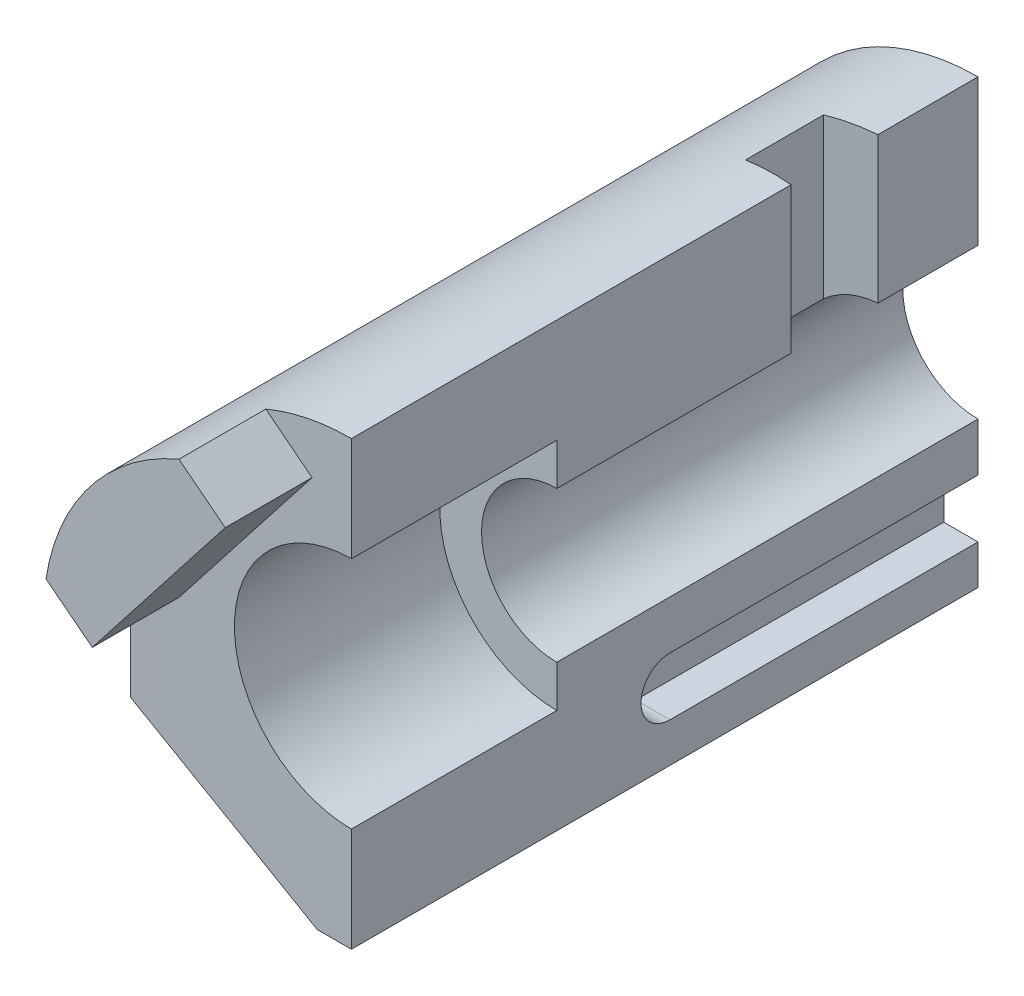
ISO-10303-21;
HEADER;
FILE_DESCRIPTION(('STEP AP214'),'2;1');
FILE_NAME('part.step','',(''),(''),'','','');
FILE_SCHEMA(('AUTOMOTIVE_DESIGN { 1 0 10303 214 1 1 1 1 }'));
ENDSEC;
DATA;
#1=APPLICATION_CONTEXT('core data for automotive mechanical design processes');
#2=APPLICATION_PROTOCOL_DEFINITION('international standard','automotive_design',2000,#1);
#3=PRODUCT_CONTEXT('',#1,'mechanical');
#4=PRODUCT('Part','Part','',(#3));
#5=PRODUCT_RELATED_PRODUCT_CATEGORY('part','',(#4));
#6=PRODUCT_DEFINITION_FORMATION('','',#4);
#7=PRODUCT_DEFINITION_CONTEXT('part definition',#1,'design');
#8=PRODUCT_DEFINITION('design','',#6,#7);
#9=PRODUCT_DEFINITION_SHAPE('','',#8);
#10=(LENGTH_UNIT() NAMED_UNIT(*) SI_UNIT(.MILLI.,.METRE.));
#11=(NAMED_UNIT(*) PLANE_ANGLE_UNIT() SI_UNIT($,.RADIAN.));
#12=(NAMED_UNIT(*) SI_UNIT($,.STERADIAN.) SOLID_ANGLE_UNIT());
#13=UNCERTAINTY_MEASURE_WITH_UNIT(LENGTH_MEASURE(1.E-05),#10,'distance_accuracy_value','');
#14=(GEOMETRIC_REPRESENTATION_CONTEXT(3) GLOBAL_UNCERTAINTY_ASSIGNED_CONTEXT((#13)) GLOBAL_UNIT_ASSIGNED_CONTEXT((#10,
#11,#12)) REPRESENTATION_CONTEXT('',''));
#15=CARTESIAN_POINT('',(0.,0.,0.));
#16=DIRECTION('',(0.,0.,1.));
#17=DIRECTION('',(1.,0.,0.));
#18=AXIS2_PLACEMENT_3D('',#15,#16,#17);
#19=CARTESIAN_POINT('',(0.,0.,238.));
#20=DIRECTION('',(0.,0.,-1.));
#21=DIRECTION('',(-1.,0.,0.));
#22=AXIS2_PLACEMENT_3D('',#19,#20,#21);
#23=PLANE('',#22);
#24=DIRECTION('',(-0.788010753606725,0.615661475325655,0.));
#25=VECTOR('',#24,1.);
#26=CARTESIAN_POINT('',(-14.9464279455912,63.7071761394841,238.));
#27=LINE('',#26,#25);
#28=CARTESIAN_POINT('',(-14.9464279455912,63.7071761394841,238.));
#29=VERTEX_POINT('',#28);
#30=CARTESIAN_POINT('',(-32.5304084023254,77.4452873271054,238.));
#31=VERTEX_POINT('',#30);
#32=EDGE_CURVE('E53',#29,#31,#27,.T.);
#33=ORIENTED_EDGE('',*,*,#32,.F.);
#34=DIRECTION('',(0.615661475325654,0.788010753606726,0.));
#35=VECTOR('',#34,1.);
#36=CARTESIAN_POINT('',(-65.4306689222948,-0.909705656267424,238.));
#37=LINE('',#36,#35);
#38=CARTESIAN_POINT('',(-65.4306689222948,-0.909705656267424,238.));
#39=VERTEX_POINT('',#38);
#40=EDGE_CURVE('E398',#39,#29,#37,.T.);
#41=ORIENTED_EDGE('',*,*,#40,.F.);
#42=DIRECTION('',(0.788010753606725,-0.615661475325655,0.));
#43=VECTOR('',#42,1.);
#44=CARTESIAN_POINT('',(-83.014649379029,12.8284055313539,238.));
#45=LINE('',#44,#43);
#46=CARTESIAN_POINT('',(-83.014649379029,12.8284055313539,238.));
#47=VERTEX_POINT('',#46);
#48=EDGE_CURVE('E59',#47,#39,#45,.T.);
#49=ORIENTED_EDGE('',*,*,#48,.F.);
#50=CARTESIAN_POINT('',(0.,0.,238.));
#51=DIRECTION('',(0.,0.,1.));
#52=DIRECTION('',(-1.,0.,0.));
#53=AXIS2_PLACEMENT_3D('',#50,#51,#52);
#54=CIRCLE('',#53,84.);
#55=CARTESIAN_POINT('',(-84.,0.,238.));
#56=VERTEX_POINT('',#55);
#57=EDGE_CURVE('E202',#47,#56,#54,.T.);
#58=ORIENTED_EDGE('',*,*,#57,.T.);
#59=DIRECTION('',(0.,-1.,0.));
#60=VECTOR('',#59,1.);
#61=CARTESIAN_POINT('',(-84.,-43.0081308875371,238.));
#62=LINE('',#61,#60);
#63=CARTESIAN_POINT('',(-84.,-43.0081308875371,238.));
#64=VERTEX_POINT('',#63);
#65=EDGE_CURVE('E273',#56,#64,#62,.T.);
#66=ORIENTED_EDGE('',*,*,#65,.T.);
#67=DIRECTION('',(0.866025403784442,-0.499999999999995,0.));
#68=VECTOR('',#67,1.);
#69=CARTESIAN_POINT('',(-84.,-43.0081308875371,238.));
#70=LINE('',#69,#68);
#71=CARTESIAN_POINT('',(-13.,-84.,238.));
#72=VERTEX_POINT('',#71);
#73=EDGE_CURVE('E260',#64,#72,#70,.T.);
#74=ORIENTED_EDGE('',*,*,#73,.T.);
#75=DIRECTION('',(1.,0.,0.));
#76=VECTOR('',#75,1.);
#77=CARTESIAN_POINT('',(-13.,-84.,238.));
#78=LINE('',#77,#76);
#79=CARTESIAN_POINT('',(0.,-84.,238.));
#80=VERTEX_POINT('',#79);
#81=EDGE_CURVE('E263',#72,#80,#78,.T.);
#82=ORIENTED_EDGE('',*,*,#81,.T.);
#83=DIRECTION('',(0.,1.,0.));
#84=VECTOR('',#83,1.);
#85=CARTESIAN_POINT('',(0.,-84.,238.));
#86=LINE('',#85,#84);
#87=CARTESIAN_POINT('',(0.,-44.45,238.));
#88=VERTEX_POINT('',#87);
#89=EDGE_CURVE('E266',#80,#88,#86,.T.);
#90=ORIENTED_EDGE('',*,*,#89,.T.);
#91=CARTESIAN_POINT('',(0.,0.,238.));
#92=DIRECTION('',(0.,0.,1.));
#93=DIRECTION('',(1.,0.,0.));
#94=AXIS2_PLACEMENT_3D('',#91,#92,#93);
#95=CIRCLE('',#94,44.45);
#96=CARTESIAN_POINT('',(0.,44.45,238.));
#97=VERTEX_POINT('',#96);
#98=EDGE_CURVE('E244',#97,#88,#95,.T.);
#99=ORIENTED_EDGE('',*,*,#98,.F.);
#100=DIRECTION('',(0.,1.,0.));
#101=VECTOR('',#100,1.);
#102=CARTESIAN_POINT('',(0.,28.575,238.));
#103=LINE('',#102,#101);
#104=CARTESIAN_POINT('',(0.,84.,238.));
#105=VERTEX_POINT('',#104);
#106=EDGE_CURVE('E269',#97,#105,#103,.T.);
#107=ORIENTED_EDGE('',*,*,#106,.T.);
#108=EDGE_CURVE('E271',#105,#31,#54,.T.);
#109=ORIENTED_EDGE('',*,*,#108,.T.);
#110=EDGE_LOOP('',(#33,#41,#49,#58,#66,#74,#82,#90,#99,#107,#109));
#111=FACE_BOUND('',#110,.T.);
#112=ADVANCED_FACE('F38',(#111),#23,.F.);
#113=CARTESIAN_POINT('',(0.,28.575,238.));
#114=DIRECTION('',(-1.,0.,0.));
#115=DIRECTION('',(0.,0.,1.));
#116=AXIS2_PLACEMENT_3D('',#113,#114,#115);
#117=PLANE('',#116);
#118=DIRECTION('',(0.,0.,-1.));
#119=VECTOR('',#118,1.);
#120=CARTESIAN_POINT('',(0.,28.575,238.));
#121=LINE('',#120,#119);
#122=CARTESIAN_POINT('',(0.,28.575,160.));
#123=VERTEX_POINT('',#122);
#124=CARTESIAN_POINT('',(0.,28.575,71.));
#125=VERTEX_POINT('',#124);
#126=EDGE_CURVE('E302',#123,#125,#121,.T.);
#127=ORIENTED_EDGE('',*,*,#126,.T.);
#128=DIRECTION('',(0.,-1.,0.));
#129=VECTOR('',#128,1.);
#130=CARTESIAN_POINT('',(0.,86.,71.));
#131=LINE('',#130,#129);
#132=CARTESIAN_POINT('',(0.,84.,71.));
#133=VERTEX_POINT('',#132);
#134=EDGE_CURVE('E226',#133,#125,#131,.T.);
#135=ORIENTED_EDGE('',*,*,#134,.F.);
#136=DIRECTION('',(0.,0.,-1.));
#137=VECTOR('',#136,1.);
#138=CARTESIAN_POINT('',(0.,84.,238.));
#139=LINE('',#138,#137);
#140=EDGE_CURVE('E299',#105,#133,#139,.T.);
#141=ORIENTED_EDGE('',*,*,#140,.F.);
#142=ORIENTED_EDGE('',*,*,#106,.F.);
#143=DIRECTION('',(0.,0.,1.));
#144=VECTOR('',#143,1.);
#145=CARTESIAN_POINT('',(0.,44.45,160.));
#146=LINE('',#145,#144);
#147=CARTESIAN_POINT('',(0.,44.45,160.));
#148=VERTEX_POINT('',#147);
#149=EDGE_CURVE('E248',#97,#148,#146,.F.);
#150=ORIENTED_EDGE('',*,*,#149,.T.);
#151=DIRECTION('',(0.,1.,0.));
#152=VECTOR('',#151,1.);
#153=CARTESIAN_POINT('',(0.,28.575,160.));
#154=LINE('',#153,#152);
#155=EDGE_CURVE('E314',#123,#148,#154,.T.);
#156=ORIENTED_EDGE('',*,*,#155,.F.);
#157=EDGE_LOOP('',(#127,#135,#141,#142,#150,#156));
#158=FACE_BOUND('',#157,.T.);
#159=ADVANCED_FACE('F386',(#158),#117,.F.);
#160=CARTESIAN_POINT('',(0.,0.,238.));
#161=DIRECTION('',(0.,0.,-1.));
#162=DIRECTION('',(-1.,0.,0.));
#163=AXIS2_PLACEMENT_3D('',#160,#161,#162);
#164=CYLINDRICAL_SURFACE('',#163,28.575);
#165=DIRECTION('',(0.,0.,-1.));
#166=VECTOR('',#165,1.);
#167=CARTESIAN_POINT('',(-19.,21.3431634253219,238.));
#168=LINE('',#167,#166);
#169=CARTESIAN_POINT('',(-19.,21.3431634253219,69.3377153930074));
#170=VERTEX_POINT('',#169);
#171=CARTESIAN_POINT('',(-19.,21.3431634253219,39.6622846069926));
#172=VERTEX_POINT('',#171);
#173=EDGE_CURVE('E236',#170,#172,#168,.T.);
#174=ORIENTED_EDGE('',*,*,#173,.F.);
#175=CARTESIAN_POINT('',(0.,0.,71.));
#176=DIRECTION('',(-0.0871557427476584,0.,0.996194698091746));
#177=DIRECTION('',(-0.996194698091746,0.,-0.0871557427476584));
#178=AXIS2_PLACEMENT_3D('',#175,#176,#177);
#179=ELLIPSE('',#178,28.6841518578012,28.575);
#180=EDGE_CURVE('E241',#170,#125,#179,.F.);
#181=ORIENTED_EDGE('',*,*,#180,.T.);
#182=ORIENTED_EDGE('',*,*,#126,.F.);
#183=CARTESIAN_POINT('',(0.,0.,160.));
#184=DIRECTION('',(0.,0.,1.));
#185=DIRECTION('',(1.,0.,0.));
#186=AXIS2_PLACEMENT_3D('',#183,#184,#185);
#187=CIRCLE('',#186,28.575);
#188=CARTESIAN_POINT('',(0.,-28.575,160.));
#189=VERTEX_POINT('',#188);
#190=EDGE_CURVE('E255',#189,#123,#187,.F.);
#191=ORIENTED_EDGE('',*,*,#190,.F.);
#192=DIRECTION('',(0.,0.,-1.));
#193=VECTOR('',#192,1.);
#194=CARTESIAN_POINT('',(0.,-28.575,238.));
#195=LINE('',#194,#193);
#196=CARTESIAN_POINT('',(0.,-28.575,0.));
#197=VERTEX_POINT('',#196);
#198=EDGE_CURVE('E305',#189,#197,#195,.T.);
#199=ORIENTED_EDGE('',*,*,#198,.T.);
#200=CARTESIAN_POINT('',(0.,0.,0.));
#201=DIRECTION('',(0.,0.,-1.));
#202=DIRECTION('',(-1.,0.,0.));
#203=AXIS2_PLACEMENT_3D('',#200,#201,#202);
#204=CIRCLE('',#203,28.575);
#205=CARTESIAN_POINT('',(0.,28.575,0.));
#206=VERTEX_POINT('',#205);
#207=EDGE_CURVE('E284',#197,#206,#204,.T.);
#208=ORIENTED_EDGE('',*,*,#207,.T.);
#209=CARTESIAN_POINT('',(0.,28.575,38.));
#210=VERTEX_POINT('',#209);
#211=EDGE_CURVE('E301',#210,#206,#121,.T.);
#212=ORIENTED_EDGE('',*,*,#211,.F.);
#213=CARTESIAN_POINT('',(0.,0.,38.));
#214=DIRECTION('',(-0.0871557427476584,0.,-0.996194698091746));
#215=DIRECTION('',(0.996194698091746,0.,-0.0871557427476584));
#216=AXIS2_PLACEMENT_3D('',#213,#214,#215);
#217=ELLIPSE('',#216,28.6841518578012,28.575);
#218=EDGE_CURVE('E238',#210,#172,#217,.F.);
#219=ORIENTED_EDGE('',*,*,#218,.T.);
#220=EDGE_LOOP('',(#174,#181,#182,#191,#199,#208,#212,#219));
#221=FACE_BOUND('',#220,.T.);
#222=ADVANCED_FACE('F375',(#221),#164,.F.);
#223=CARTESIAN_POINT('',(-84.,-43.0081308875371,238.));
#224=DIRECTION('',(0.499999999999995,0.866025403784442,0.));
#225=DIRECTION('',(-0.866025403784442,0.499999999999995,0.));
#226=AXIS2_PLACEMENT_3D('',#223,#224,#225);
#227=PLANE('',#226);
#228=DIRECTION('',(0.866025403784442,-0.499999999999995,0.));
#229=VECTOR('',#228,1.);
#230=CARTESIAN_POINT('',(-84.,-43.0081308875371,0.));
#231=LINE('',#230,#229);
#232=CARTESIAN_POINT('',(-84.,-43.0081308875371,0.));
#233=VERTEX_POINT('',#232);
#234=CARTESIAN_POINT('',(-13.,-84.,0.));
#235=VERTEX_POINT('',#234);
#236=EDGE_CURVE('E259',#233,#235,#231,.T.);
#237=ORIENTED_EDGE('',*,*,#236,.T.);
#238=DIRECTION('',(0.,0.,-1.));
#239=VECTOR('',#238,1.);
#240=CARTESIAN_POINT('',(-13.,-84.,238.));
#241=LINE('',#240,#239);
#242=EDGE_CURVE('E311',#72,#235,#241,.T.);
#243=ORIENTED_EDGE('',*,*,#242,.F.);
#244=ORIENTED_EDGE('',*,*,#73,.F.);
#245=DIRECTION('',(0.,0.,-1.));
#246=VECTOR('',#245,1.);
#247=CARTESIAN_POINT('',(-84.,-43.0081308875371,238.));
#248=LINE('',#247,#246);
#249=EDGE_CURVE('E275',#64,#233,#248,.T.);
#250=ORIENTED_EDGE('',*,*,#249,.T.);
#251=EDGE_LOOP('',(#237,#243,#244,#250));
#252=FACE_BOUND('',#251,.T.);
#253=ADVANCED_FACE('F40',(#252),#227,.F.);
#254=CARTESIAN_POINT('',(-13.,-84.,238.));
#255=DIRECTION('',(0.,1.,0.));
#256=DIRECTION('',(0.,0.,1.));
#257=AXIS2_PLACEMENT_3D('',#254,#255,#256);
#258=PLANE('',#257);
#259=DIRECTION('',(1.,0.,0.));
#260=VECTOR('',#259,1.);
#261=CARTESIAN_POINT('',(-13.,-84.,0.));
#262=LINE('',#261,#260);
#263=CARTESIAN_POINT('',(0.,-84.,0.));
#264=VERTEX_POINT('',#263);
#265=EDGE_CURVE('E278',#235,#264,#262,.T.);
#266=ORIENTED_EDGE('',*,*,#265,.T.);
#267=DIRECTION('',(0.,0.,-1.));
#268=VECTOR('',#267,1.);
#269=CARTESIAN_POINT('',(0.,-84.,238.));
#270=LINE('',#269,#268);
#271=EDGE_CURVE('E308',#80,#264,#270,.T.);
#272=ORIENTED_EDGE('',*,*,#271,.F.);
#273=ORIENTED_EDGE('',*,*,#81,.F.);
#274=ORIENTED_EDGE('',*,*,#242,.T.);
#275=EDGE_LOOP('',(#266,#272,#273,#274));
#276=FACE_BOUND('',#275,.T.);
#277=ADVANCED_FACE('F356',(#276),#258,.F.);
#278=CARTESIAN_POINT('',(0.,-84.,238.));
#279=DIRECTION('',(-1.,0.,0.));
#280=DIRECTION('',(0.,0.,1.));
#281=AXIS2_PLACEMENT_3D('',#278,#279,#280);
#282=PLANE('',#281);
#283=CARTESIAN_POINT('',(0.,-58.,117.));
#284=DIRECTION('',(1.,0.,0.));
#285=DIRECTION('',(0.,1.,0.));
#286=AXIS2_PLACEMENT_3D('',#283,#284,#285);
#287=CIRCLE('',#286,11.);
#288=CARTESIAN_POINT('',(0.,-47.,117.));
#289=VERTEX_POINT('',#288);
#290=CARTESIAN_POINT('',(0.,-69.,117.));
#291=VERTEX_POINT('',#290);
#292=EDGE_CURVE('E203',#289,#291,#287,.T.);
#293=ORIENTED_EDGE('',*,*,#292,.F.);
#294=DIRECTION('',(0.,0.,1.));
#295=VECTOR('',#294,1.);
#296=CARTESIAN_POINT('',(0.,-47.,117.));
#297=LINE('',#296,#295);
#298=CARTESIAN_POINT('',(0.,-47.,0.));
#299=VERTEX_POINT('',#298);
#300=EDGE_CURVE('E216',#299,#289,#297,.T.);
#301=ORIENTED_EDGE('',*,*,#300,.F.);
#302=DIRECTION('',(0.,1.,0.));
#303=VECTOR('',#302,1.);
#304=CARTESIAN_POINT('',(0.,-84.,0.));
#305=LINE('',#304,#303);
#306=EDGE_CURVE('E280',#299,#197,#305,.T.);
#307=ORIENTED_EDGE('',*,*,#306,.T.);
#308=ORIENTED_EDGE('',*,*,#198,.F.);
#309=DIRECTION('',(0.,1.,0.));
#310=VECTOR('',#309,1.);
#311=CARTESIAN_POINT('',(0.,-84.,160.));
#312=LINE('',#311,#310);
#313=CARTESIAN_POINT('',(0.,-44.45,160.));
#314=VERTEX_POINT('',#313);
#315=EDGE_CURVE('E257',#314,#189,#312,.T.);
#316=ORIENTED_EDGE('',*,*,#315,.F.);
#317=DIRECTION('',(0.,0.,1.));
#318=VECTOR('',#317,1.);
#319=CARTESIAN_POINT('',(0.,-44.45,160.));
#320=LINE('',#319,#318);
#321=EDGE_CURVE('E252',#314,#88,#320,.T.);
#322=ORIENTED_EDGE('',*,*,#321,.T.);
#323=ORIENTED_EDGE('',*,*,#89,.F.);
#324=ORIENTED_EDGE('',*,*,#271,.T.);
#325=CARTESIAN_POINT('',(0.,-69.,0.));
#326=VERTEX_POINT('',#325);
#327=EDGE_CURVE('E281',#264,#326,#305,.T.);
#328=ORIENTED_EDGE('',*,*,#327,.T.);
#329=DIRECTION('',(0.,0.,-1.));
#330=VECTOR('',#329,1.);
#331=CARTESIAN_POINT('',(0.,-69.,117.));
#332=LINE('',#331,#330);
#333=EDGE_CURVE('E206',#291,#326,#332,.T.);
#334=ORIENTED_EDGE('',*,*,#333,.F.);
#335=EDGE_LOOP('',(#293,#301,#307,#308,#316,#322,#323,#324,#328,#334));
#336=FACE_BOUND('',#335,.T.);
#337=ADVANCED_FACE('F349',(#336),#282,.F.);
#338=CARTESIAN_POINT('',(0.,84.,38.));
#339=VERTEX_POINT('',#338);
#340=CARTESIAN_POINT('',(0.,84.,0.));
#341=VERTEX_POINT('',#340);
#342=EDGE_CURVE('E298',#339,#341,#139,.T.);
#343=ORIENTED_EDGE('',*,*,#342,.F.);
#344=DIRECTION('',(0.,1.,0.));
#345=VECTOR('',#344,1.);
#346=CARTESIAN_POINT('',(0.,86.,38.));
#347=LINE('',#346,#345);
#348=EDGE_CURVE('E229',#210,#339,#347,.T.);
#349=ORIENTED_EDGE('',*,*,#348,.F.);
#350=ORIENTED_EDGE('',*,*,#211,.T.);
#351=DIRECTION('',(0.,1.,0.));
#352=VECTOR('',#351,1.);
#353=CARTESIAN_POINT('',(0.,28.575,0.));
#354=LINE('',#353,#352);
#355=EDGE_CURVE('E287',#206,#341,#354,.T.);
#356=ORIENTED_EDGE('',*,*,#355,.T.);
#357=EDGE_LOOP('',(#343,#349,#350,#356));
#358=FACE_BOUND('',#357,.T.);
#359=ADVANCED_FACE('F371',(#358),#117,.F.);
#360=CARTESIAN_POINT('',(0.,0.,238.));
#361=DIRECTION('',(0.,0.,-1.));
#362=DIRECTION('',(-1.,0.,0.));
#363=AXIS2_PLACEMENT_3D('',#360,#361,#362);
#364=CYLINDRICAL_SURFACE('',#363,84.);
#365=ORIENTED_EDGE('',*,*,#140,.T.);
#366=CARTESIAN_POINT('',(0.,0.,71.));
#367=DIRECTION('',(-0.0871557427476584,0.,0.996194698091746));
#368=DIRECTION('',(-0.996194698091746,0.,-0.0871557427476584));
#369=AXIS2_PLACEMENT_3D('',#366,#367,#368);
#370=ELLIPSE('',#369,84.3208663536412,84.);
#371=CARTESIAN_POINT('',(-19.,81.8229796573065,69.3377153930075));
#372=VERTEX_POINT('',#371);
#373=EDGE_CURVE('E321',#133,#372,#370,.T.);
#374=ORIENTED_EDGE('',*,*,#373,.T.);
#375=DIRECTION('',(0.,0.,-1.));
#376=VECTOR('',#375,1.);
#377=CARTESIAN_POINT('',(-19.,81.8229796573065,238.));
#378=LINE('',#377,#376);
#379=CARTESIAN_POINT('',(-19.,81.8229796573065,39.6622846069925));
#380=VERTEX_POINT('',#379);
#381=EDGE_CURVE('E316',#380,#372,#378,.F.);
#382=ORIENTED_EDGE('',*,*,#381,.F.);
#383=CARTESIAN_POINT('',(0.,0.,38.));
#384=DIRECTION('',(-0.0871557427476584,0.,-0.996194698091746));
#385=DIRECTION('',(0.996194698091746,0.,-0.0871557427476584));
#386=AXIS2_PLACEMENT_3D('',#383,#384,#385);
#387=ELLIPSE('',#386,84.3208663536412,84.);
#388=EDGE_CURVE('E318',#380,#339,#387,.T.);
#389=ORIENTED_EDGE('',*,*,#388,.T.);
#390=ORIENTED_EDGE('',*,*,#342,.T.);
#391=CARTESIAN_POINT('',(0.,0.,0.));
#392=DIRECTION('',(0.,0.,1.));
#393=DIRECTION('',(-1.,0.,0.));
#394=AXIS2_PLACEMENT_3D('',#391,#392,#393);
#395=CIRCLE('',#394,84.);
#396=CARTESIAN_POINT('',(-84.,0.,0.));
#397=VERTEX_POINT('',#396);
#398=EDGE_CURVE('E290',#341,#397,#395,.T.);
#399=ORIENTED_EDGE('',*,*,#398,.T.);
#400=DIRECTION('',(0.,0.,-1.));
#401=VECTOR('',#400,1.);
#402=CARTESIAN_POINT('',(-84.,0.,238.));
#403=LINE('',#402,#401);
#404=EDGE_CURVE('E295',#56,#397,#403,.T.);
#405=ORIENTED_EDGE('',*,*,#404,.F.);
#406=ORIENTED_EDGE('',*,*,#57,.F.);
#407=DIRECTION('',(0.,0.,-1.));
#408=VECTOR('',#407,1.);
#409=CARTESIAN_POINT('',(-83.014649379029,12.8284055313539,271.));
#410=LINE('',#409,#408);
#411=CARTESIAN_POINT('',(-83.014649379029,12.8284055313539,271.));
#412=VERTEX_POINT('',#411);
#413=EDGE_CURVE('E183',#412,#47,#410,.T.);
#414=ORIENTED_EDGE('',*,*,#413,.F.);
#415=CARTESIAN_POINT('',(0.,0.,271.));
#416=DIRECTION('',(0.,0.,1.));
#417=DIRECTION('',(1.,0.,0.));
#418=AXIS2_PLACEMENT_3D('',#415,#416,#417);
#419=CIRCLE('',#418,84.);
#420=CARTESIAN_POINT('',(-32.5304084023254,77.4452873271054,271.));
#421=VERTEX_POINT('',#420);
#422=EDGE_CURVE('E189',#421,#412,#419,.T.);
#423=ORIENTED_EDGE('',*,*,#422,.F.);
#424=DIRECTION('',(0.,0.,-1.));
#425=VECTOR('',#424,1.);
#426=CARTESIAN_POINT('',(-32.5304084023254,77.4452873271054,271.));
#427=LINE('',#426,#425);
#428=EDGE_CURVE('E393',#421,#31,#427,.T.);
#429=ORIENTED_EDGE('',*,*,#428,.T.);
#430=ORIENTED_EDGE('',*,*,#108,.F.);
#431=EDGE_LOOP('',(#365,#374,#382,#389,#390,#399,#405,#406,#414,#423,#429,#430));
#432=FACE_BOUND('',#431,.T.);
#433=ADVANCED_FACE('F200',(#432),#364,.T.);
#434=CARTESIAN_POINT('',(-84.,-43.0081308875371,238.));
#435=DIRECTION('',(1.,0.,0.));
#436=DIRECTION('',(0.,1.,0.));
#437=AXIS2_PLACEMENT_3D('',#434,#435,#436);
#438=PLANE('',#437);
#439=DIRECTION('',(0.,-1.,0.));
#440=VECTOR('',#439,1.);
#441=CARTESIAN_POINT('',(-84.,-43.0081308875371,0.));
#442=LINE('',#441,#440);
#443=EDGE_CURVE('E264',#397,#233,#442,.T.);
#444=ORIENTED_EDGE('',*,*,#443,.T.);
#445=ORIENTED_EDGE('',*,*,#249,.F.);
#446=ORIENTED_EDGE('',*,*,#65,.F.);
#447=ORIENTED_EDGE('',*,*,#404,.T.);
#448=EDGE_LOOP('',(#444,#445,#446,#447));
#449=FACE_BOUND('',#448,.T.);
#450=ADVANCED_FACE('F362',(#449),#438,.F.);
#451=CARTESIAN_POINT('',(0.,0.,0.));
#452=DIRECTION('',(0.,0.,-1.));
#453=DIRECTION('',(-1.,0.,0.));
#454=AXIS2_PLACEMENT_3D('',#451,#452,#453);
#455=PLANE('',#454);
#456=DIRECTION('',(1.,0.,0.));
#457=VECTOR('',#456,1.);
#458=CARTESIAN_POINT('',(0.,-47.,0.));
#459=LINE('',#458,#457);
#460=CARTESIAN_POINT('',(-13.,-47.,0.));
#461=VERTEX_POINT('',#460);
#462=EDGE_CURVE('E11',#461,#299,#459,.T.);
#463=ORIENTED_EDGE('',*,*,#462,.F.);
#464=DIRECTION('',(0.,-1.,0.));
#465=VECTOR('',#464,1.);
#466=CARTESIAN_POINT('',(-13.,0.,0.));
#467=LINE('',#466,#465);
#468=CARTESIAN_POINT('',(-13.,-69.,0.));
#469=VERTEX_POINT('',#468);
#470=EDGE_CURVE('E324',#461,#469,#467,.T.);
#471=ORIENTED_EDGE('',*,*,#470,.T.);
#472=DIRECTION('',(-1.,0.,0.));
#473=VECTOR('',#472,1.);
#474=CARTESIAN_POINT('',(0.,-69.,0.));
#475=LINE('',#474,#473);
#476=EDGE_CURVE('E46',#326,#469,#475,.T.);
#477=ORIENTED_EDGE('',*,*,#476,.F.);
#478=ORIENTED_EDGE('',*,*,#327,.F.);
#479=ORIENTED_EDGE('',*,*,#265,.F.);
#480=ORIENTED_EDGE('',*,*,#236,.F.);
#481=ORIENTED_EDGE('',*,*,#443,.F.);
#482=ORIENTED_EDGE('',*,*,#398,.F.);
#483=ORIENTED_EDGE('',*,*,#355,.F.);
#484=ORIENTED_EDGE('',*,*,#207,.F.);
#485=ORIENTED_EDGE('',*,*,#306,.F.);
#486=EDGE_LOOP('',(#463,#471,#477,#478,#479,#480,#481,#482,#483,#484,#485));
#487=FACE_BOUND('',#486,.T.);
#488=ADVANCED_FACE('F335',(#487),#455,.T.);
#489=CARTESIAN_POINT('',(0.,0.,160.));
#490=DIRECTION('',(0.,0.,1.));
#491=DIRECTION('',(1.,0.,0.));
#492=AXIS2_PLACEMENT_3D('',#489,#490,#491);
#493=PLANE('',#492);
#494=ORIENTED_EDGE('',*,*,#315,.T.);
#495=ORIENTED_EDGE('',*,*,#190,.T.);
#496=ORIENTED_EDGE('',*,*,#155,.T.);
#497=CARTESIAN_POINT('',(0.,0.,160.));
#498=DIRECTION('',(0.,0.,1.));
#499=DIRECTION('',(1.,0.,0.));
#500=AXIS2_PLACEMENT_3D('',#497,#498,#499);
#501=CIRCLE('',#500,44.45);
#502=EDGE_CURVE('E245',#148,#314,#501,.T.);
#503=ORIENTED_EDGE('',*,*,#502,.T.);
#504=EDGE_LOOP('',(#494,#495,#496,#503));
#505=FACE_BOUND('',#504,.T.);
#506=ADVANCED_FACE('F380',(#505),#493,.T.);
#507=CARTESIAN_POINT('',(0.,0.,160.));
#508=DIRECTION('',(0.,0.,1.));
#509=DIRECTION('',(1.,0.,0.));
#510=AXIS2_PLACEMENT_3D('',#507,#508,#509);
#511=CYLINDRICAL_SURFACE('',#510,44.45);
#512=ORIENTED_EDGE('',*,*,#502,.F.);
#513=ORIENTED_EDGE('',*,*,#149,.F.);
#514=ORIENTED_EDGE('',*,*,#98,.T.);
#515=ORIENTED_EDGE('',*,*,#321,.F.);
#516=EDGE_LOOP('',(#512,#513,#514,#515));
#517=FACE_BOUND('',#516,.T.);
#518=ADVANCED_FACE('F390',(#517),#511,.F.);
#519=CARTESIAN_POINT('',(0.,86.,71.));
#520=DIRECTION('',(-0.0871557427476584,0.,0.996194698091746));
#521=DIRECTION('',(0.996194698091746,0.,0.0871557427476584));
#522=AXIS2_PLACEMENT_3D('',#519,#520,#521);
#523=PLANE('',#522);
#524=DIRECTION('',(0.,-1.,0.));
#525=VECTOR('',#524,1.);
#526=CARTESIAN_POINT('',(-19.,0.,69.3377153930074));
#527=LINE('',#526,#525);
#528=EDGE_CURVE('E231',#372,#170,#527,.T.);
#529=ORIENTED_EDGE('',*,*,#528,.F.);
#530=ORIENTED_EDGE('',*,*,#373,.F.);
#531=ORIENTED_EDGE('',*,*,#134,.T.);
#532=ORIENTED_EDGE('',*,*,#180,.F.);
#533=EDGE_LOOP('',(#529,#530,#531,#532));
#534=FACE_BOUND('',#533,.T.);
#535=ADVANCED_FACE('F551',(#534),#523,.F.);
#536=CARTESIAN_POINT('',(0.,86.,38.));
#537=DIRECTION('',(-0.0871557427476584,0.,-0.996194698091746));
#538=DIRECTION('',(-0.996194698091746,0.,0.0871557427476584));
#539=AXIS2_PLACEMENT_3D('',#536,#537,#538);
#540=PLANE('',#539);
#541=ORIENTED_EDGE('',*,*,#348,.T.);
#542=ORIENTED_EDGE('',*,*,#388,.F.);
#543=DIRECTION('',(0.,1.,0.));
#544=VECTOR('',#543,1.);
#545=CARTESIAN_POINT('',(-19.,0.,39.6622846069925));
#546=LINE('',#545,#544);
#547=EDGE_CURVE('E234',#172,#380,#546,.T.);
#548=ORIENTED_EDGE('',*,*,#547,.F.);
#549=ORIENTED_EDGE('',*,*,#218,.F.);
#550=EDGE_LOOP('',(#541,#542,#548,#549));
#551=FACE_BOUND('',#550,.T.);
#552=ADVANCED_FACE('F540',(#551),#540,.F.);
#553=CARTESIAN_POINT('',(-19.,0.,0.));
#554=DIRECTION('',(1.,0.,0.));
#555=DIRECTION('',(0.,0.,-1.));
#556=AXIS2_PLACEMENT_3D('',#553,#554,#555);
#557=PLANE('',#556);
#558=ORIENTED_EDGE('',*,*,#173,.T.);
#559=ORIENTED_EDGE('',*,*,#547,.T.);
#560=ORIENTED_EDGE('',*,*,#381,.T.);
#561=ORIENTED_EDGE('',*,*,#528,.T.);
#562=EDGE_LOOP('',(#558,#559,#560,#561));
#563=FACE_BOUND('',#562,.T.);
#564=ADVANCED_FACE('F530',(#563),#557,.T.);
#565=CARTESIAN_POINT('',(-13.,-58.,117.));
#566=DIRECTION('',(1.,0.,0.));
#567=DIRECTION('',(0.,1.,0.));
#568=AXIS2_PLACEMENT_3D('',#565,#566,#567);
#569=CYLINDRICAL_SURFACE('',#568,11.);
#570=ORIENTED_EDGE('',*,*,#292,.T.);
#571=DIRECTION('',(1.,0.,0.));
#572=VECTOR('',#571,1.);
#573=CARTESIAN_POINT('',(-13.,-69.,117.));
#574=LINE('',#573,#572);
#575=CARTESIAN_POINT('',(-13.,-69.,117.));
#576=VERTEX_POINT('',#575);
#577=EDGE_CURVE('E219',#576,#291,#574,.T.);
#578=ORIENTED_EDGE('',*,*,#577,.F.);
#579=CARTESIAN_POINT('',(-13.,-58.,117.));
#580=DIRECTION('',(1.,0.,0.));
#581=DIRECTION('',(0.,1.,0.));
#582=AXIS2_PLACEMENT_3D('',#579,#580,#581);
#583=CIRCLE('',#582,11.);
#584=CARTESIAN_POINT('',(-13.,-47.,117.));
#585=VERTEX_POINT('',#584);
#586=EDGE_CURVE('E212',#585,#576,#583,.T.);
#587=ORIENTED_EDGE('',*,*,#586,.F.);
#588=DIRECTION('',(1.,0.,0.));
#589=VECTOR('',#588,1.);
#590=CARTESIAN_POINT('',(-13.,-47.,117.));
#591=LINE('',#590,#589);
#592=EDGE_CURVE('E223',#585,#289,#591,.T.);
#593=ORIENTED_EDGE('',*,*,#592,.T.);
#594=EDGE_LOOP('',(#570,#578,#587,#593));
#595=FACE_BOUND('',#594,.T.);
#596=ADVANCED_FACE('F347',(#595),#569,.F.);
#597=CARTESIAN_POINT('',(-13.,-47.,117.));
#598=DIRECTION('',(0.,1.,0.));
#599=DIRECTION('',(-1.,0.,0.));
#600=AXIS2_PLACEMENT_3D('',#597,#598,#599);
#601=PLANE('',#600);
#602=ORIENTED_EDGE('',*,*,#462,.T.);
#603=ORIENTED_EDGE('',*,*,#300,.T.);
#604=ORIENTED_EDGE('',*,*,#592,.F.);
#605=DIRECTION('',(0.,0.,1.));
#606=VECTOR('',#605,1.);
#607=CARTESIAN_POINT('',(-13.,-47.,117.));
#608=LINE('',#607,#606);
#609=EDGE_CURVE('E218',#461,#585,#608,.T.);
#610=ORIENTED_EDGE('',*,*,#609,.F.);
#611=EDGE_LOOP('',(#602,#603,#604,#610));
#612=FACE_BOUND('',#611,.T.);
#613=ADVANCED_FACE('F342',(#612),#601,.F.);
#614=CARTESIAN_POINT('',(-13.,-69.,117.));
#615=DIRECTION('',(0.,-1.,0.));
#616=DIRECTION('',(1.,0.,0.));
#617=AXIS2_PLACEMENT_3D('',#614,#615,#616);
#618=PLANE('',#617);
#619=ORIENTED_EDGE('',*,*,#476,.T.);
#620=DIRECTION('',(0.,0.,-1.));
#621=VECTOR('',#620,1.);
#622=CARTESIAN_POINT('',(-13.,-69.,117.));
#623=LINE('',#622,#621);
#624=EDGE_CURVE('E215',#576,#469,#623,.T.);
#625=ORIENTED_EDGE('',*,*,#624,.F.);
#626=ORIENTED_EDGE('',*,*,#577,.T.);
#627=ORIENTED_EDGE('',*,*,#333,.T.);
#628=EDGE_LOOP('',(#619,#625,#626,#627));
#629=FACE_BOUND('',#628,.T.);
#630=ADVANCED_FACE('F330',(#629),#618,.F.);
#631=CARTESIAN_POINT('',(-13.,-58.,117.));
#632=DIRECTION('',(1.,0.,0.));
#633=DIRECTION('',(0.,1.,0.));
#634=AXIS2_PLACEMENT_3D('',#631,#632,#633);
#635=PLANE('',#634);
#636=ORIENTED_EDGE('',*,*,#609,.T.);
#637=ORIENTED_EDGE('',*,*,#586,.T.);
#638=ORIENTED_EDGE('',*,*,#624,.T.);
#639=ORIENTED_EDGE('',*,*,#470,.F.);
#640=EDGE_LOOP('',(#636,#637,#638,#639));
#641=FACE_BOUND('',#640,.T.);
#642=ADVANCED_FACE('F339',(#641),#635,.T.);
#643=CARTESIAN_POINT('',(-83.014649379029,12.8284055313539,271.));
#644=DIRECTION('',(0.615661475325655,0.788010753606725,0.));
#645=DIRECTION('',(-0.788010753606725,0.615661475325655,0.));
#646=AXIS2_PLACEMENT_3D('',#643,#644,#645);
#647=PLANE('',#646);
#648=ORIENTED_EDGE('',*,*,#48,.T.);
#649=DIRECTION('',(0.,0.,-1.));
#650=VECTOR('',#649,1.);
#651=CARTESIAN_POINT('',(-65.4306689222948,-0.909705656267424,271.));
#652=LINE('',#651,#650);
#653=CARTESIAN_POINT('',(-65.4306689222948,-0.909705656267424,271.));
#654=VERTEX_POINT('',#653);
#655=EDGE_CURVE('E185',#654,#39,#652,.T.);
#656=ORIENTED_EDGE('',*,*,#655,.F.);
#657=DIRECTION('',(0.788010753606725,-0.615661475325655,0.));
#658=VECTOR('',#657,1.);
#659=CARTESIAN_POINT('',(-83.014649379029,12.8284055313539,271.));
#660=LINE('',#659,#658);
#661=EDGE_CURVE('E179',#412,#654,#660,.T.);
#662=ORIENTED_EDGE('',*,*,#661,.F.);
#663=ORIENTED_EDGE('',*,*,#413,.T.);
#664=EDGE_LOOP('',(#648,#656,#662,#663));
#665=FACE_BOUND('',#664,.T.);
#666=ADVANCED_FACE('F181',(#665),#647,.F.);
#667=CARTESIAN_POINT('',(-65.4306689222948,-0.909705656267424,271.));
#668=DIRECTION('',(-0.788010753606726,0.615661475325654,0.));
#669=DIRECTION('',(-0.615661475325654,-0.788010753606726,0.));
#670=AXIS2_PLACEMENT_3D('',#667,#668,#669);
#671=PLANE('',#670);
#672=ORIENTED_EDGE('',*,*,#40,.T.);
#673=DIRECTION('',(0.,0.,-1.));
#674=VECTOR('',#673,1.);
#675=CARTESIAN_POINT('',(-14.9464279455912,63.7071761394841,271.));
#676=LINE('',#675,#674);
#677=CARTESIAN_POINT('',(-14.9464279455912,63.7071761394841,271.));
#678=VERTEX_POINT('',#677);
#679=EDGE_CURVE('E208',#678,#29,#676,.T.);
#680=ORIENTED_EDGE('',*,*,#679,.F.);
#681=DIRECTION('',(0.615661475325654,0.788010753606726,0.));
#682=VECTOR('',#681,1.);
#683=CARTESIAN_POINT('',(-65.4306689222948,-0.909705656267424,271.));
#684=LINE('',#683,#682);
#685=EDGE_CURVE('E188',#654,#678,#684,.T.);
#686=ORIENTED_EDGE('',*,*,#685,.F.);
#687=ORIENTED_EDGE('',*,*,#655,.T.);
#688=EDGE_LOOP('',(#672,#680,#686,#687));
#689=FACE_BOUND('',#688,.T.);
#690=ADVANCED_FACE('F406',(#689),#671,.F.);
#691=CARTESIAN_POINT('',(-14.9464279455912,63.7071761394841,271.));
#692=DIRECTION('',(-0.615661475325655,-0.788010753606725,0.));
#693=DIRECTION('',(0.788010753606725,-0.615661475325655,0.));
#694=AXIS2_PLACEMENT_3D('',#691,#692,#693);
#695=PLANE('',#694);
#696=ORIENTED_EDGE('',*,*,#32,.T.);
#697=ORIENTED_EDGE('',*,*,#428,.F.);
#698=DIRECTION('',(-0.788010753606725,0.615661475325655,0.));
#699=VECTOR('',#698,1.);
#700=CARTESIAN_POINT('',(-14.9464279455912,63.7071761394841,271.));
#701=LINE('',#700,#699);
#702=EDGE_CURVE('E194',#678,#421,#701,.T.);
#703=ORIENTED_EDGE('',*,*,#702,.F.);
#704=ORIENTED_EDGE('',*,*,#679,.T.);
#705=EDGE_LOOP('',(#696,#697,#703,#704));
#706=FACE_BOUND('',#705,.T.);
#707=ADVANCED_FACE('F396',(#706),#695,.F.);
#708=CARTESIAN_POINT('',(0.,0.,271.));
#709=DIRECTION('',(0.,0.,1.));
#710=DIRECTION('',(1.,0.,0.));
#711=AXIS2_PLACEMENT_3D('',#708,#709,#710);
#712=PLANE('',#711);
#713=ORIENTED_EDGE('',*,*,#422,.T.);
#714=ORIENTED_EDGE('',*,*,#661,.T.);
#715=ORIENTED_EDGE('',*,*,#685,.T.);
#716=ORIENTED_EDGE('',*,*,#702,.T.);
#717=EDGE_LOOP('',(#713,#714,#715,#716));
#718=FACE_BOUND('',#717,.T.);
#719=ADVANCED_FACE('F192',(#718),#712,.T.);
#720=CLOSED_SHELL('',(#112,#159,#222,#253,#277,#337,#359,#433,#450,#488,#506,#518,#535,#552,
#564,#596,#613,#630,#642,#666,#690,#707,#719));
#721=MANIFOLD_SOLID_BREP('B2',#720);
#722=ADVANCED_BREP_SHAPE_REPRESENTATION('',(#18,#721),#14);
#723=SHAPE_DEFINITION_REPRESENTATION(#9,#722);
ENDSEC;
END-ISO-10303-21;
